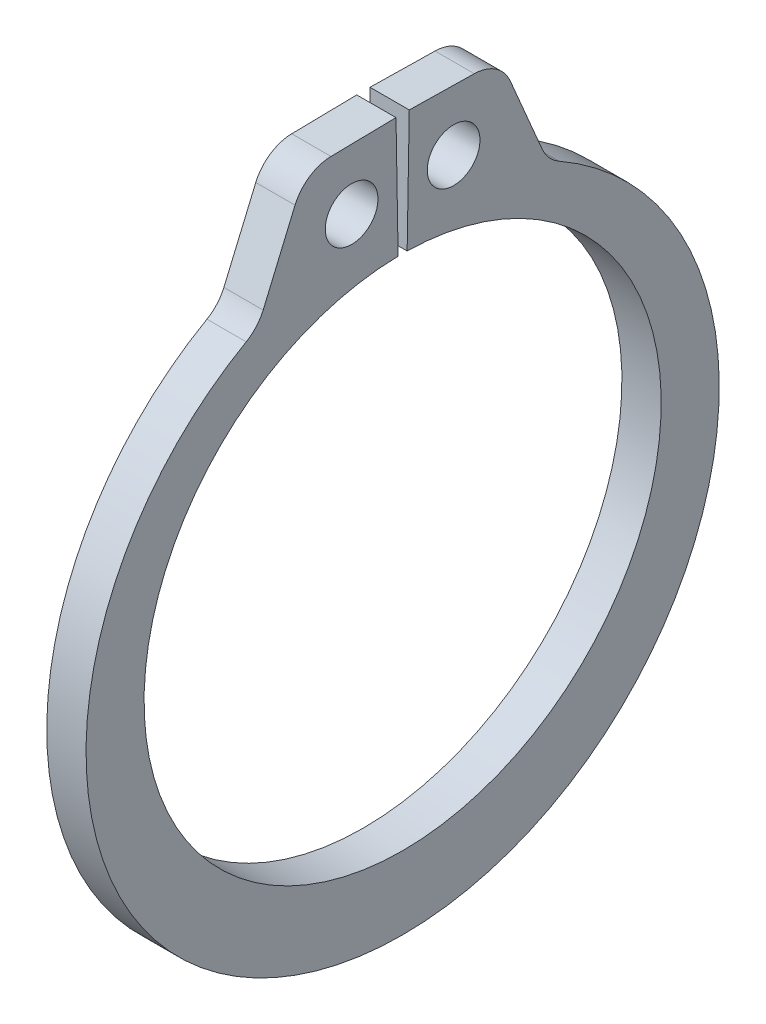
ISO-10303-21;
HEADER;
FILE_DESCRIPTION(('STEP AP214'),'2;1');
FILE_NAME('part.step','',(''),(''),'','','');
FILE_SCHEMA(('AUTOMOTIVE_DESIGN { 1 0 10303 214 1 1 1 1 }'));
ENDSEC;
DATA;
#1=APPLICATION_CONTEXT('core data for automotive mechanical design processes');
#2=APPLICATION_PROTOCOL_DEFINITION('international standard','automotive_design',2000,#1);
#3=PRODUCT_CONTEXT('',#1,'mechanical');
#4=PRODUCT('Part','Part','',(#3));
#5=PRODUCT_RELATED_PRODUCT_CATEGORY('part','',(#4));
#6=PRODUCT_DEFINITION_FORMATION('','',#4);
#7=PRODUCT_DEFINITION_CONTEXT('part definition',#1,'design');
#8=PRODUCT_DEFINITION('design','',#6,#7);
#9=PRODUCT_DEFINITION_SHAPE('','',#8);
#10=(LENGTH_UNIT() NAMED_UNIT(*) SI_UNIT(.MILLI.,.METRE.));
#11=(NAMED_UNIT(*) PLANE_ANGLE_UNIT() SI_UNIT($,.RADIAN.));
#12=(NAMED_UNIT(*) SI_UNIT($,.STERADIAN.) SOLID_ANGLE_UNIT());
#13=UNCERTAINTY_MEASURE_WITH_UNIT(LENGTH_MEASURE(1.E-05),#10,'distance_accuracy_value','');
#14=(GEOMETRIC_REPRESENTATION_CONTEXT(3) GLOBAL_UNCERTAINTY_ASSIGNED_CONTEXT((#13)) GLOBAL_UNIT_ASSIGNED_CONTEXT((#10,
#11,#12)) REPRESENTATION_CONTEXT('',''));
#15=CARTESIAN_POINT('',(0.,0.,0.));
#16=DIRECTION('',(0.,0.,1.));
#17=DIRECTION('',(1.,0.,0.));
#18=AXIS2_PLACEMENT_3D('',#15,#16,#17);
#19=CARTESIAN_POINT('',(0.4445,0.,0.));
#20=DIRECTION('',(1.,0.,0.));
#21=DIRECTION('',(0.,0.,-1.));
#22=AXIS2_PLACEMENT_3D('',#19,#20,#21);
#23=PLANE('',#22);
#24=CARTESIAN_POINT('',(0.4445,7.20724610900659,-1.15465964864513));
#25=DIRECTION('',(-1.,0.,0.));
#26=DIRECTION('',(0.,0.,1.));
#27=AXIS2_PLACEMENT_3D('',#24,#25,#26);
#28=CIRCLE('',#27,0.5969);
#29=CARTESIAN_POINT('',(0.4445,7.20724610900659,-0.557759648645126));
#30=VERTEX_POINT('',#29);
#31=EDGE_CURVE('E170',#30,#30,#28,.T.);
#32=ORIENTED_EDGE('',*,*,#31,.T.);
#33=EDGE_LOOP('',(#32));
#34=FACE_BOUND('',#33,.T.);
#35=CARTESIAN_POINT('',(0.4445,7.20724610900659,1.15465964864513));
#36=DIRECTION('',(-1.,0.,0.));
#37=DIRECTION('',(0.,0.,1.));
#38=AXIS2_PLACEMENT_3D('',#35,#36,#37);
#39=CIRCLE('',#38,0.5969);
#40=CARTESIAN_POINT('',(0.4445,7.20724610900659,1.75155964864513));
#41=VERTEX_POINT('',#40);
#42=EDGE_CURVE('E108',#41,#41,#39,.T.);
#43=ORIENTED_EDGE('',*,*,#42,.T.);
#44=EDGE_LOOP('',(#43));
#45=FACE_BOUND('',#44,.T.);
#46=CARTESIAN_POINT('',(0.4445,0.,0.));
#47=DIRECTION('',(-1.,0.,0.));
#48=DIRECTION('',(0.,0.,1.));
#49=AXIS2_PLACEMENT_3D('',#46,#47,#48);
#50=CIRCLE('',#49,5.8547);
#51=CARTESIAN_POINT('',(0.4445,5.85380830083212,-0.102178603968365));
#52=VERTEX_POINT('',#51);
#53=CARTESIAN_POINT('',(0.4445,5.85380830083212,0.102178603968365));
#54=VERTEX_POINT('',#53);
#55=EDGE_CURVE('E176',#52,#54,#50,.T.);
#56=ORIENTED_EDGE('',*,*,#55,.T.);
#57=DIRECTION('',(0.,-0.999847695156391,-0.0174524064372833));
#58=VECTOR('',#57,1.);
#59=CARTESIAN_POINT('',(0.4445,5.85380830083212,0.102178603968365));
#60=LINE('',#59,#58);
#61=CARTESIAN_POINT('',(0.4445,8.59659049818515,0.15005404530712));
#62=VERTEX_POINT('',#61);
#63=EDGE_CURVE('E123',#54,#62,#60,.F.);
#64=ORIENTED_EDGE('',*,*,#63,.T.);
#65=DIRECTION('',(0.,0.01745240643729,-0.999847695156391));
#66=VECTOR('',#65,1.);
#67=CARTESIAN_POINT('',(0.4445,8.59659049818515,0.15005404530712));
#68=LINE('',#67,#66);
#69=CARTESIAN_POINT('',(0.4445,8.5708933863481,1.62224059647238));
#70=VERTEX_POINT('',#69);
#71=EDGE_CURVE('E118',#62,#70,#68,.F.);
#72=ORIENTED_EDGE('',*,*,#71,.T.);
#73=CARTESIAN_POINT('',(0.4445,7.66933071962559,1.60650376158788));
#74=DIRECTION('',(-1.,0.,0.));
#75=DIRECTION('',(0.,0.,1.));
#76=AXIS2_PLACEMENT_3D('',#73,#74,#75);
#77=CIRCLE('',#76,0.9017);
#78=CARTESIAN_POINT('',(0.4445,8.02240621636442,2.43620285379096));
#79=VERTEX_POINT('',#78);
#80=EDGE_CURVE('E111',#79,#70,#77,.T.);
#81=ORIENTED_EDGE('',*,*,#80,.F.);
#82=DIRECTION('',(0.,0.920149819455566,-0.391566481910657));
#83=VECTOR('',#82,1.);
#84=CARTESIAN_POINT('',(0.4445,8.56068391718106,2.20714069332188));
#85=LINE('',#84,#83);
#86=CARTESIAN_POINT('',(0.4445,6.32616456625773,3.15803245301383));
#87=VERTEX_POINT('',#86);
#88=EDGE_CURVE('E106',#79,#87,#85,.F.);
#89=ORIENTED_EDGE('',*,*,#88,.T.);
#90=CARTESIAN_POINT('',(0.4445,6.67924006299656,3.98773154521692));
#91=DIRECTION('',(-1.,0.,0.));
#92=DIRECTION('',(0.,0.,1.));
#93=AXIS2_PLACEMENT_3D('',#90,#91,#92);
#94=CIRCLE('',#93,0.9017);
#95=CARTESIAN_POINT('',(0.4445,5.89530863003734,3.54218199868087));
#96=VERTEX_POINT('',#95);
#97=EDGE_CURVE('E19',#87,#96,#94,.T.);
#98=ORIENTED_EDGE('',*,*,#97,.T.);
#99=CARTESIAN_POINT('',(0.4445,-0.337057291142251,0.));
#100=DIRECTION('',(-1.,0.,0.));
#101=DIRECTION('',(0.,0.,1.));
#102=AXIS2_PLACEMENT_3D('',#99,#100,#101);
#103=CIRCLE('',#102,7.16864270885776);
#104=CARTESIAN_POINT('',(0.4445,5.89530863003734,-3.54218199868087));
#105=VERTEX_POINT('',#104);
#106=EDGE_CURVE('E104',#105,#96,#103,.T.);
#107=ORIENTED_EDGE('',*,*,#106,.F.);
#108=CARTESIAN_POINT('',(0.4445,6.67924006299656,-3.98773154521692));
#109=DIRECTION('',(-1.,0.,0.));
#110=DIRECTION('',(0.,0.,1.));
#111=AXIS2_PLACEMENT_3D('',#108,#109,#110);
#112=CIRCLE('',#111,0.9017);
#113=CARTESIAN_POINT('',(0.4445,6.32616456625773,-3.15803245301383));
#114=VERTEX_POINT('',#113);
#115=EDGE_CURVE('E180',#105,#114,#112,.T.);
#116=ORIENTED_EDGE('',*,*,#115,.T.);
#117=DIRECTION('',(0.,-0.920149819455566,-0.391566481910657));
#118=VECTOR('',#117,1.);
#119=CARTESIAN_POINT('',(0.4445,8.56068391718106,-2.20714069332188));
#120=LINE('',#119,#118);
#121=CARTESIAN_POINT('',(0.4445,8.02240621636442,-2.43620285379096));
#122=VERTEX_POINT('',#121);
#123=EDGE_CURVE('E141',#114,#122,#120,.F.);
#124=ORIENTED_EDGE('',*,*,#123,.T.);
#125=CARTESIAN_POINT('',(0.4445,7.66933071962559,-1.60650376158788));
#126=DIRECTION('',(-1.,0.,0.));
#127=DIRECTION('',(0.,0.,1.));
#128=AXIS2_PLACEMENT_3D('',#125,#126,#127);
#129=CIRCLE('',#128,0.9017);
#130=CARTESIAN_POINT('',(0.4445,8.5708933863481,-1.62224059647238));
#131=VERTEX_POINT('',#130);
#132=EDGE_CURVE('E143',#131,#122,#129,.T.);
#133=ORIENTED_EDGE('',*,*,#132,.F.);
#134=DIRECTION('',(0.,-0.01745240643729,-0.999847695156391));
#135=VECTOR('',#134,1.);
#136=CARTESIAN_POINT('',(0.4445,8.59659049818515,-0.15005404530712));
#137=LINE('',#136,#135);
#138=CARTESIAN_POINT('',(0.4445,8.59659049818515,-0.15005404530712));
#139=VERTEX_POINT('',#138);
#140=EDGE_CURVE('E135',#131,#139,#137,.F.);
#141=ORIENTED_EDGE('',*,*,#140,.T.);
#142=DIRECTION('',(0.,0.999847695156391,-0.0174524064372833));
#143=VECTOR('',#142,1.);
#144=CARTESIAN_POINT('',(0.4445,5.85380830083212,-0.102178603968365));
#145=LINE('',#144,#143);
#146=EDGE_CURVE('E129',#139,#52,#145,.F.);
#147=ORIENTED_EDGE('',*,*,#146,.T.);
#148=EDGE_LOOP('',(#56,#64,#72,#81,#89,#98,#107,#116,#124,#133,#141,#147));
#149=FACE_BOUND('',#148,.T.);
#150=ADVANCED_FACE('F16',(#34,#45,#149),#23,.T.);
#151=CARTESIAN_POINT('',(0.4445,6.67924006299656,3.98773154521692));
#152=DIRECTION('',(-1.,0.,0.));
#153=DIRECTION('',(0.,0.,1.));
#154=AXIS2_PLACEMENT_3D('',#151,#152,#153);
#155=CYLINDRICAL_SURFACE('',#154,0.9017);
#156=DIRECTION('',(1.,0.,0.));
#157=VECTOR('',#156,1.);
#158=CARTESIAN_POINT('',(0.4445,6.32616456625773,3.15803245301383));
#159=LINE('',#158,#157);
#160=CARTESIAN_POINT('',(-0.4445,6.32616456625773,3.15803245301383));
#161=VERTEX_POINT('',#160);
#162=EDGE_CURVE('E100',#87,#161,#159,.F.);
#163=ORIENTED_EDGE('',*,*,#162,.T.);
#164=CARTESIAN_POINT('',(-0.4445,6.67924006299656,3.98773154521692));
#165=DIRECTION('',(-1.,0.,0.));
#166=DIRECTION('',(0.,0.,1.));
#167=AXIS2_PLACEMENT_3D('',#164,#165,#166);
#168=CIRCLE('',#167,0.9017);
#169=CARTESIAN_POINT('',(-0.4445,5.89530863003734,3.54218199868087));
#170=VERTEX_POINT('',#169);
#171=EDGE_CURVE('E168',#161,#170,#168,.T.);
#172=ORIENTED_EDGE('',*,*,#171,.T.);
#173=DIRECTION('',(-1.,0.,0.));
#174=VECTOR('',#173,1.);
#175=CARTESIAN_POINT('',(0.4445,5.89530863003735,3.54218199868087));
#176=LINE('',#175,#174);
#177=EDGE_CURVE('E101',#96,#170,#176,.T.);
#178=ORIENTED_EDGE('',*,*,#177,.F.);
#179=ORIENTED_EDGE('',*,*,#97,.F.);
#180=EDGE_LOOP('',(#163,#172,#178,#179));
#181=FACE_BOUND('',#180,.T.);
#182=ADVANCED_FACE('F98',(#181),#155,.F.);
#183=CARTESIAN_POINT('',(0.4445,-0.337057291142251,0.));
#184=DIRECTION('',(-1.,0.,0.));
#185=DIRECTION('',(0.,0.,1.));
#186=AXIS2_PLACEMENT_3D('',#183,#184,#185);
#187=CYLINDRICAL_SURFACE('',#186,7.16864270885776);
#188=CARTESIAN_POINT('',(-0.4445,-0.337057291142251,0.));
#189=DIRECTION('',(-1.,0.,0.));
#190=DIRECTION('',(0.,0.,1.));
#191=AXIS2_PLACEMENT_3D('',#188,#189,#190);
#192=CIRCLE('',#191,7.16864270885776);
#193=CARTESIAN_POINT('',(-0.4445,5.89530863003733,-3.54218199868086));
#194=VERTEX_POINT('',#193);
#195=EDGE_CURVE('E165',#170,#194,#192,.F.);
#196=ORIENTED_EDGE('',*,*,#195,.T.);
#197=DIRECTION('',(-1.,0.,0.));
#198=VECTOR('',#197,1.);
#199=CARTESIAN_POINT('',(0.4445,5.89530863003733,-3.54218199868086));
#200=LINE('',#199,#198);
#201=EDGE_CURVE('E181',#194,#105,#200,.F.);
#202=ORIENTED_EDGE('',*,*,#201,.T.);
#203=ORIENTED_EDGE('',*,*,#106,.T.);
#204=ORIENTED_EDGE('',*,*,#177,.T.);
#205=EDGE_LOOP('',(#196,#202,#203,#204));
#206=FACE_BOUND('',#205,.T.);
#207=ADVANCED_FACE('F264',(#206),#187,.T.);
#208=CARTESIAN_POINT('',(0.4445,6.67924006299656,-3.98773154521692));
#209=DIRECTION('',(-1.,0.,0.));
#210=DIRECTION('',(0.,0.,1.));
#211=AXIS2_PLACEMENT_3D('',#208,#209,#210);
#212=CYLINDRICAL_SURFACE('',#211,0.9017);
#213=ORIENTED_EDGE('',*,*,#201,.F.);
#214=CARTESIAN_POINT('',(-0.4445,6.67924006299656,-3.98773154521692));
#215=DIRECTION('',(-1.,0.,0.));
#216=DIRECTION('',(0.,0.,1.));
#217=AXIS2_PLACEMENT_3D('',#214,#215,#216);
#218=CIRCLE('',#217,0.9017);
#219=CARTESIAN_POINT('',(-0.4445,6.32616456625773,-3.15803245301383));
#220=VERTEX_POINT('',#219);
#221=EDGE_CURVE('E162',#194,#220,#218,.T.);
#222=ORIENTED_EDGE('',*,*,#221,.T.);
#223=DIRECTION('',(1.,0.,0.));
#224=VECTOR('',#223,1.);
#225=CARTESIAN_POINT('',(0.4445,6.32616456625773,-3.15803245301383));
#226=LINE('',#225,#224);
#227=EDGE_CURVE('E144',#220,#114,#226,.T.);
#228=ORIENTED_EDGE('',*,*,#227,.T.);
#229=ORIENTED_EDGE('',*,*,#115,.F.);
#230=EDGE_LOOP('',(#213,#222,#228,#229));
#231=FACE_BOUND('',#230,.T.);
#232=ADVANCED_FACE('F263',(#231),#212,.F.);
#233=CARTESIAN_POINT('',(0.4445,8.56068391718106,-2.20714069332188));
#234=DIRECTION('',(0.,-0.391566481910657,0.920149819455566));
#235=DIRECTION('',(0.,-0.920149819455566,-0.391566481910657));
#236=AXIS2_PLACEMENT_3D('',#233,#234,#235);
#237=PLANE('',#236);
#238=ORIENTED_EDGE('',*,*,#227,.F.);
#239=DIRECTION('',(0.,0.920149819455567,0.391566481910655));
#240=VECTOR('',#239,1.);
#241=CARTESIAN_POINT('',(-0.4445,6.32616456625773,-3.15803245301383));
#242=LINE('',#241,#240);
#243=CARTESIAN_POINT('',(-0.4445,8.02240621636442,-2.43620285379096));
#244=VERTEX_POINT('',#243);
#245=EDGE_CURVE('E161',#220,#244,#242,.T.);
#246=ORIENTED_EDGE('',*,*,#245,.T.);
#247=DIRECTION('',(-1.,0.,0.));
#248=VECTOR('',#247,1.);
#249=CARTESIAN_POINT('',(0.4445,8.02240621636442,-2.43620285379097));
#250=LINE('',#249,#248);
#251=EDGE_CURVE('E179',#122,#244,#250,.T.);
#252=ORIENTED_EDGE('',*,*,#251,.F.);
#253=ORIENTED_EDGE('',*,*,#123,.F.);
#254=EDGE_LOOP('',(#238,#246,#252,#253));
#255=FACE_BOUND('',#254,.T.);
#256=ADVANCED_FACE('F260',(#255),#237,.F.);
#257=CARTESIAN_POINT('',(0.4445,7.66933071962559,-1.60650376158788));
#258=DIRECTION('',(-1.,0.,0.));
#259=DIRECTION('',(0.,0.,1.));
#260=AXIS2_PLACEMENT_3D('',#257,#258,#259);
#261=CYLINDRICAL_SURFACE('',#260,0.9017);
#262=CARTESIAN_POINT('',(-0.4445,7.66933071962559,-1.60650376158788));
#263=DIRECTION('',(-1.,0.,0.));
#264=DIRECTION('',(0.,0.,1.));
#265=AXIS2_PLACEMENT_3D('',#262,#263,#264);
#266=CIRCLE('',#265,0.9017);
#267=CARTESIAN_POINT('',(-0.4445,8.57089338634811,-1.62224059647238));
#268=VERTEX_POINT('',#267);
#269=EDGE_CURVE('E157',#244,#268,#266,.F.);
#270=ORIENTED_EDGE('',*,*,#269,.T.);
#271=DIRECTION('',(1.,0.,0.));
#272=VECTOR('',#271,1.);
#273=CARTESIAN_POINT('',(0.4445,8.5708933863481,-1.62224059647238));
#274=LINE('',#273,#272);
#275=EDGE_CURVE('E138',#268,#131,#274,.T.);
#276=ORIENTED_EDGE('',*,*,#275,.T.);
#277=ORIENTED_EDGE('',*,*,#132,.T.);
#278=ORIENTED_EDGE('',*,*,#251,.T.);
#279=EDGE_LOOP('',(#270,#276,#277,#278));
#280=FACE_BOUND('',#279,.T.);
#281=ADVANCED_FACE('F255',(#280),#261,.T.);
#282=CARTESIAN_POINT('',(0.4445,8.59659049818515,-0.15005404530712));
#283=DIRECTION('',(0.,-0.999847695156391,0.01745240643729));
#284=DIRECTION('',(0.,-0.01745240643729,-0.999847695156391));
#285=AXIS2_PLACEMENT_3D('',#282,#283,#284);
#286=PLANE('',#285);
#287=ORIENTED_EDGE('',*,*,#275,.F.);
#288=DIRECTION('',(0.,0.0174524064372866,0.999847695156391));
#289=VECTOR('',#288,1.);
#290=CARTESIAN_POINT('',(-0.4445,8.57089338634811,-1.62224059647238));
#291=LINE('',#290,#289);
#292=CARTESIAN_POINT('',(-0.4445,8.59659049818515,-0.15005404530712));
#293=VERTEX_POINT('',#292);
#294=EDGE_CURVE('E160',#268,#293,#291,.T.);
#295=ORIENTED_EDGE('',*,*,#294,.T.);
#296=DIRECTION('',(1.,0.,0.));
#297=VECTOR('',#296,1.);
#298=CARTESIAN_POINT('',(0.4445,8.59659049818515,-0.15005404530712));
#299=LINE('',#298,#297);
#300=EDGE_CURVE('E132',#293,#139,#299,.T.);
#301=ORIENTED_EDGE('',*,*,#300,.T.);
#302=ORIENTED_EDGE('',*,*,#140,.F.);
#303=EDGE_LOOP('',(#287,#295,#301,#302));
#304=FACE_BOUND('',#303,.T.);
#305=ADVANCED_FACE('F250',(#304),#286,.F.);
#306=CARTESIAN_POINT('',(0.4445,5.85380830083212,-0.102178603968365));
#307=DIRECTION('',(0.,-0.0174524064372833,-0.999847695156391));
#308=DIRECTION('',(0.,0.999847695156391,-0.0174524064372833));
#309=AXIS2_PLACEMENT_3D('',#306,#307,#308);
#310=PLANE('',#309);
#311=DIRECTION('',(-1.,0.,0.));
#312=VECTOR('',#311,1.);
#313=CARTESIAN_POINT('',(0.4445,5.85380830083212,-0.102178603968365));
#314=LINE('',#313,#312);
#315=CARTESIAN_POINT('',(-0.4445,5.85380830083212,-0.102178603968365));
#316=VERTEX_POINT('',#315);
#317=EDGE_CURVE('E131',#316,#52,#314,.F.);
#318=ORIENTED_EDGE('',*,*,#317,.T.);
#319=ORIENTED_EDGE('',*,*,#146,.F.);
#320=ORIENTED_EDGE('',*,*,#300,.F.);
#321=DIRECTION('',(0.,-0.999847695156391,0.0174524064372832));
#322=VECTOR('',#321,1.);
#323=CARTESIAN_POINT('',(-0.4445,8.59659049818515,-0.15005404530712));
#324=LINE('',#323,#322);
#325=EDGE_CURVE('E156',#293,#316,#324,.T.);
#326=ORIENTED_EDGE('',*,*,#325,.T.);
#327=EDGE_LOOP('',(#318,#319,#320,#326));
#328=FACE_BOUND('',#327,.T.);
#329=ADVANCED_FACE('F245',(#328),#310,.F.);
#330=CARTESIAN_POINT('',(0.4445,0.,0.));
#331=DIRECTION('',(-1.,0.,0.));
#332=DIRECTION('',(0.,0.,1.));
#333=AXIS2_PLACEMENT_3D('',#330,#331,#332);
#334=CYLINDRICAL_SURFACE('',#333,5.8547);
#335=ORIENTED_EDGE('',*,*,#317,.F.);
#336=CARTESIAN_POINT('',(-0.4445,0.,0.));
#337=DIRECTION('',(-1.,0.,0.));
#338=DIRECTION('',(0.,0.,1.));
#339=AXIS2_PLACEMENT_3D('',#336,#337,#338);
#340=CIRCLE('',#339,5.8547);
#341=CARTESIAN_POINT('',(-0.4445,5.85380830083212,0.102178603968365));
#342=VERTEX_POINT('',#341);
#343=EDGE_CURVE('E152',#316,#342,#340,.T.);
#344=ORIENTED_EDGE('',*,*,#343,.T.);
#345=DIRECTION('',(1.,0.,0.));
#346=VECTOR('',#345,1.);
#347=CARTESIAN_POINT('',(0.4445,5.85380830083212,0.102178603968365));
#348=LINE('',#347,#346);
#349=EDGE_CURVE('E126',#342,#54,#348,.T.);
#350=ORIENTED_EDGE('',*,*,#349,.T.);
#351=ORIENTED_EDGE('',*,*,#55,.F.);
#352=EDGE_LOOP('',(#335,#344,#350,#351));
#353=FACE_BOUND('',#352,.T.);
#354=ADVANCED_FACE('F240',(#353),#334,.F.);
#355=CARTESIAN_POINT('',(0.4445,5.85380830083212,0.102178603968365));
#356=DIRECTION('',(0.,-0.0174524064372833,0.999847695156391));
#357=DIRECTION('',(0.,-0.999847695156391,-0.0174524064372833));
#358=AXIS2_PLACEMENT_3D('',#355,#356,#357);
#359=PLANE('',#358);
#360=DIRECTION('',(1.,0.,0.));
#361=VECTOR('',#360,1.);
#362=CARTESIAN_POINT('',(0.4445,8.59659049818515,0.15005404530712));
#363=LINE('',#362,#361);
#364=CARTESIAN_POINT('',(-0.4445,8.59659049818515,0.15005404530712));
#365=VERTEX_POINT('',#364);
#366=EDGE_CURVE('E120',#365,#62,#363,.T.);
#367=ORIENTED_EDGE('',*,*,#366,.T.);
#368=ORIENTED_EDGE('',*,*,#63,.F.);
#369=ORIENTED_EDGE('',*,*,#349,.F.);
#370=DIRECTION('',(0.,0.999847695156391,0.0174524064372832));
#371=VECTOR('',#370,1.);
#372=CARTESIAN_POINT('',(-0.4445,5.85380830083212,0.102178603968365));
#373=LINE('',#372,#371);
#374=EDGE_CURVE('E155',#342,#365,#373,.T.);
#375=ORIENTED_EDGE('',*,*,#374,.T.);
#376=EDGE_LOOP('',(#367,#368,#369,#375));
#377=FACE_BOUND('',#376,.T.);
#378=ADVANCED_FACE('F236',(#377),#359,.F.);
#379=CARTESIAN_POINT('',(0.4445,8.59659049818515,0.15005404530712));
#380=DIRECTION('',(0.,-0.999847695156391,-0.01745240643729));
#381=DIRECTION('',(0.,0.01745240643729,-0.999847695156391));
#382=AXIS2_PLACEMENT_3D('',#379,#380,#381);
#383=PLANE('',#382);
#384=DIRECTION('',(-1.,0.,0.));
#385=VECTOR('',#384,1.);
#386=CARTESIAN_POINT('',(0.4445,8.5708933863481,1.62224059647238));
#387=LINE('',#386,#385);
#388=CARTESIAN_POINT('',(-0.4445,8.57089338634811,1.62224059647238));
#389=VERTEX_POINT('',#388);
#390=EDGE_CURVE('E113',#70,#389,#387,.T.);
#391=ORIENTED_EDGE('',*,*,#390,.F.);
#392=ORIENTED_EDGE('',*,*,#71,.F.);
#393=ORIENTED_EDGE('',*,*,#366,.F.);
#394=DIRECTION('',(0.,-0.0174524064372866,0.999847695156391));
#395=VECTOR('',#394,1.);
#396=CARTESIAN_POINT('',(-0.4445,8.59659049818515,0.15005404530712));
#397=LINE('',#396,#395);
#398=EDGE_CURVE('E151',#365,#389,#397,.T.);
#399=ORIENTED_EDGE('',*,*,#398,.T.);
#400=EDGE_LOOP('',(#391,#392,#393,#399));
#401=FACE_BOUND('',#400,.T.);
#402=ADVANCED_FACE('F227',(#401),#383,.F.);
#403=CARTESIAN_POINT('',(0.4445,7.66933071962559,1.60650376158788));
#404=DIRECTION('',(-1.,0.,0.));
#405=DIRECTION('',(0.,0.,1.));
#406=AXIS2_PLACEMENT_3D('',#403,#404,#405);
#407=CYLINDRICAL_SURFACE('',#406,0.9017);
#408=CARTESIAN_POINT('',(-0.4445,7.66933071962559,1.60650376158788));
#409=DIRECTION('',(-1.,0.,0.));
#410=DIRECTION('',(0.,0.,1.));
#411=AXIS2_PLACEMENT_3D('',#408,#409,#410);
#412=CIRCLE('',#411,0.9017);
#413=CARTESIAN_POINT('',(-0.4445,8.02240621636442,2.43620285379096));
#414=VERTEX_POINT('',#413);
#415=EDGE_CURVE('E148',#389,#414,#412,.F.);
#416=ORIENTED_EDGE('',*,*,#415,.T.);
#417=DIRECTION('',(1.,0.,0.));
#418=VECTOR('',#417,1.);
#419=CARTESIAN_POINT('',(0.4445,8.02240621636442,2.43620285379096));
#420=LINE('',#419,#418);
#421=EDGE_CURVE('E34',#414,#79,#420,.T.);
#422=ORIENTED_EDGE('',*,*,#421,.T.);
#423=ORIENTED_EDGE('',*,*,#80,.T.);
#424=ORIENTED_EDGE('',*,*,#390,.T.);
#425=EDGE_LOOP('',(#416,#422,#423,#424));
#426=FACE_BOUND('',#425,.T.);
#427=ADVANCED_FACE('F291',(#426),#407,.T.);
#428=CARTESIAN_POINT('',(0.4445,8.56068391718106,2.20714069332188));
#429=DIRECTION('',(0.,-0.391566481910657,-0.920149819455566));
#430=DIRECTION('',(0.,0.920149819455566,-0.391566481910657));
#431=AXIS2_PLACEMENT_3D('',#428,#429,#430);
#432=PLANE('',#431);
#433=ORIENTED_EDGE('',*,*,#162,.F.);
#434=ORIENTED_EDGE('',*,*,#88,.F.);
#435=ORIENTED_EDGE('',*,*,#421,.F.);
#436=DIRECTION('',(0.,-0.920149819455567,0.391566481910655));
#437=VECTOR('',#436,1.);
#438=CARTESIAN_POINT('',(-0.4445,8.02240621636442,2.43620285379096));
#439=LINE('',#438,#437);
#440=EDGE_CURVE('E107',#414,#161,#439,.T.);
#441=ORIENTED_EDGE('',*,*,#440,.T.);
#442=EDGE_LOOP('',(#433,#434,#435,#441));
#443=FACE_BOUND('',#442,.T.);
#444=ADVANCED_FACE('F105',(#443),#432,.F.);
#445=CARTESIAN_POINT('',(0.4445,7.20724610900659,1.15465964864513));
#446=DIRECTION('',(-1.,0.,0.));
#447=DIRECTION('',(0.,0.,1.));
#448=AXIS2_PLACEMENT_3D('',#445,#446,#447);
#449=CYLINDRICAL_SURFACE('',#448,0.5969);
#450=CARTESIAN_POINT('',(-0.4445,7.20724610900659,1.15465964864513));
#451=DIRECTION('',(-1.,0.,0.));
#452=DIRECTION('',(0.,0.,1.));
#453=AXIS2_PLACEMENT_3D('',#450,#451,#452);
#454=CIRCLE('',#453,0.5969);
#455=CARTESIAN_POINT('',(-0.4445,7.20724610900659,1.75155964864513));
#456=VERTEX_POINT('',#455);
#457=EDGE_CURVE('E25',#456,#456,#454,.T.);
#458=ORIENTED_EDGE('',*,*,#457,.T.);
#459=EDGE_LOOP('',(#458));
#460=FACE_BOUND('',#459,.T.);
#461=ORIENTED_EDGE('',*,*,#42,.F.);
#462=EDGE_LOOP('',(#461));
#463=FACE_BOUND('',#462,.T.);
#464=ADVANCED_FACE('F280',(#460,#463),#449,.F.);
#465=CARTESIAN_POINT('',(0.4445,7.20724610900659,-1.15465964864513));
#466=DIRECTION('',(-1.,0.,0.));
#467=DIRECTION('',(0.,0.,1.));
#468=AXIS2_PLACEMENT_3D('',#465,#466,#467);
#469=CYLINDRICAL_SURFACE('',#468,0.5969);
#470=CARTESIAN_POINT('',(-0.4445,7.20724610900659,-1.15465964864513));
#471=DIRECTION('',(-1.,0.,0.));
#472=DIRECTION('',(0.,0.,1.));
#473=AXIS2_PLACEMENT_3D('',#470,#471,#472);
#474=CIRCLE('',#473,0.5969);
#475=CARTESIAN_POINT('',(-0.4445,7.20724610900659,-0.557759648645126));
#476=VERTEX_POINT('',#475);
#477=EDGE_CURVE('E10',#476,#476,#474,.T.);
#478=ORIENTED_EDGE('',*,*,#477,.T.);
#479=EDGE_LOOP('',(#478));
#480=FACE_BOUND('',#479,.T.);
#481=ORIENTED_EDGE('',*,*,#31,.F.);
#482=EDGE_LOOP('',(#481));
#483=FACE_BOUND('',#482,.T.);
#484=ADVANCED_FACE('F274',(#480,#483),#469,.F.);
#485=CARTESIAN_POINT('',(-0.4445,0.,0.));
#486=DIRECTION('',(1.,0.,0.));
#487=DIRECTION('',(0.,0.,-1.));
#488=AXIS2_PLACEMENT_3D('',#485,#486,#487);
#489=PLANE('',#488);
#490=ORIENTED_EDGE('',*,*,#477,.F.);
#491=EDGE_LOOP('',(#490));
#492=FACE_BOUND('',#491,.T.);
#493=ORIENTED_EDGE('',*,*,#457,.F.);
#494=EDGE_LOOP('',(#493));
#495=FACE_BOUND('',#494,.T.);
#496=ORIENTED_EDGE('',*,*,#415,.F.);
#497=ORIENTED_EDGE('',*,*,#398,.F.);
#498=ORIENTED_EDGE('',*,*,#374,.F.);
#499=ORIENTED_EDGE('',*,*,#343,.F.);
#500=ORIENTED_EDGE('',*,*,#325,.F.);
#501=ORIENTED_EDGE('',*,*,#294,.F.);
#502=ORIENTED_EDGE('',*,*,#269,.F.);
#503=ORIENTED_EDGE('',*,*,#245,.F.);
#504=ORIENTED_EDGE('',*,*,#221,.F.);
#505=ORIENTED_EDGE('',*,*,#195,.F.);
#506=ORIENTED_EDGE('',*,*,#171,.F.);
#507=ORIENTED_EDGE('',*,*,#440,.F.);
#508=EDGE_LOOP('',(#496,#497,#498,#499,#500,#501,#502,#503,#504,#505,#506,#507));
#509=FACE_BOUND('',#508,.T.);
#510=ADVANCED_FACE('F232',(#492,#495,#509),#489,.F.);
#511=CLOSED_SHELL('',(#150,#182,#207,#232,#256,#281,#305,#329,#354,#378,#402,#427,#444,#464,
#484,#510));
#512=MANIFOLD_SOLID_BREP('B1',#511);
#513=ADVANCED_BREP_SHAPE_REPRESENTATION('',(#18,#512),#14);
#514=SHAPE_DEFINITION_REPRESENTATION(#9,#513);
ENDSEC;
END-ISO-10303-21;
